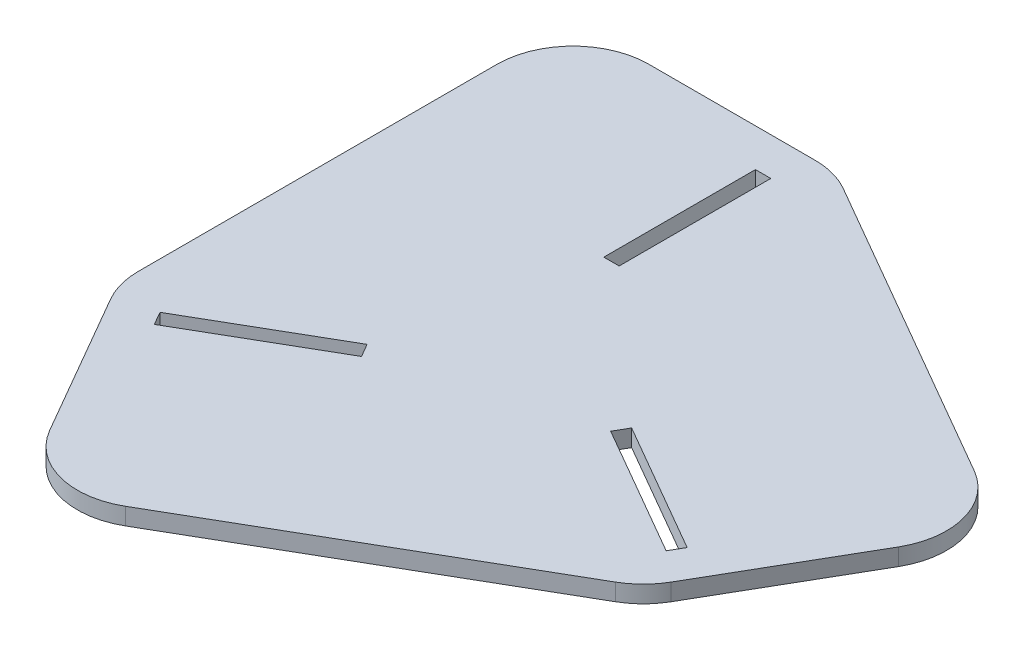
ISO-10303-21;
HEADER;
FILE_DESCRIPTION(('STEP AP214'),'2;1');
FILE_NAME('part.step','',(''),(''),'','','');
FILE_SCHEMA(('AUTOMOTIVE_DESIGN { 1 0 10303 214 1 1 1 1 }'));
ENDSEC;
DATA;
#1=APPLICATION_CONTEXT('core data for automotive mechanical design processes');
#2=APPLICATION_PROTOCOL_DEFINITION('international standard','automotive_design',2000,#1);
#3=PRODUCT_CONTEXT('',#1,'mechanical');
#4=PRODUCT('Part','Part','',(#3));
#5=PRODUCT_RELATED_PRODUCT_CATEGORY('part','',(#4));
#6=PRODUCT_DEFINITION_FORMATION('','',#4);
#7=PRODUCT_DEFINITION_CONTEXT('part definition',#1,'design');
#8=PRODUCT_DEFINITION('design','',#6,#7);
#9=PRODUCT_DEFINITION_SHAPE('','',#8);
#10=(LENGTH_UNIT() NAMED_UNIT(*) SI_UNIT(.MILLI.,.METRE.));
#11=(NAMED_UNIT(*) PLANE_ANGLE_UNIT() SI_UNIT($,.RADIAN.));
#12=(NAMED_UNIT(*) SI_UNIT($,.STERADIAN.) SOLID_ANGLE_UNIT());
#13=UNCERTAINTY_MEASURE_WITH_UNIT(LENGTH_MEASURE(1.E-05),#10,'distance_accuracy_value','');
#14=(GEOMETRIC_REPRESENTATION_CONTEXT(3) GLOBAL_UNCERTAINTY_ASSIGNED_CONTEXT((#13)) GLOBAL_UNIT_ASSIGNED_CONTEXT((#10,
#11,#12)) REPRESENTATION_CONTEXT('',''));
#15=CARTESIAN_POINT('',(0.,0.,0.));
#16=DIRECTION('',(0.,0.,1.));
#17=DIRECTION('',(1.,0.,0.));
#18=AXIS2_PLACEMENT_3D('',#15,#16,#17);
#19=CARTESIAN_POINT('',(25.9807621135332,4.5,15.));
#20=DIRECTION('',(0.866025403784439,0.,0.499999999999999));
#21=DIRECTION('',(0.499999999999999,0.,-0.866025403784439));
#22=AXIS2_PLACEMENT_3D('',#19,#20,#21);
#23=PLANE('',#22);
#24=DIRECTION('',(-0.499999999999999,0.,0.866025403784439));
#25=VECTOR('',#24,1.);
#26=CARTESIAN_POINT('',(25.9807621135332,0.,15.));
#27=LINE('',#26,#25);
#28=CARTESIAN_POINT('',(31.5512701892219,0.,5.3515969889343));
#29=VERTEX_POINT('',#28);
#30=CARTESIAN_POINT('',(29.5262701892219,0.,8.85899987426128));
#31=VERTEX_POINT('',#30);
#32=EDGE_CURVE('E315',#29,#31,#27,.T.);
#33=ORIENTED_EDGE('',*,*,#32,.F.);
#34=DIRECTION('',(0.,-1.,0.));
#35=VECTOR('',#34,1.);
#36=CARTESIAN_POINT('',(31.5512701892219,4.5,5.3515969889343));
#37=LINE('',#36,#35);
#38=CARTESIAN_POINT('',(31.5512701892219,4.5,5.3515969889343));
#39=VERTEX_POINT('',#38);
#40=EDGE_CURVE('E331',#39,#29,#37,.T.);
#41=ORIENTED_EDGE('',*,*,#40,.F.);
#42=DIRECTION('',(-0.499999999999999,0.,0.866025403784439));
#43=VECTOR('',#42,1.);
#44=CARTESIAN_POINT('',(25.9807621135332,4.5,15.));
#45=LINE('',#44,#43);
#46=CARTESIAN_POINT('',(29.5262701892219,4.5,8.85899987426128));
#47=VERTEX_POINT('',#46);
#48=EDGE_CURVE('E265',#39,#47,#45,.T.);
#49=ORIENTED_EDGE('',*,*,#48,.T.);
#50=DIRECTION('',(0.,-1.,0.));
#51=VECTOR('',#50,1.);
#52=CARTESIAN_POINT('',(29.5262701892219,4.5,8.85899987426128));
#53=LINE('',#52,#51);
#54=EDGE_CURVE('E323',#47,#31,#53,.T.);
#55=ORIENTED_EDGE('',*,*,#54,.T.);
#56=EDGE_LOOP('',(#33,#41,#49,#55));
#57=FACE_BOUND('',#56,.T.);
#58=ADVANCED_FACE('F43',(#57),#23,.T.);
#59=CARTESIAN_POINT('',(5.57050807568877,4.5,-9.64840301106569));
#60=DIRECTION('',(0.5,0.,-0.866025403784439));
#61=DIRECTION('',(-0.866025403784439,0.,-0.5));
#62=AXIS2_PLACEMENT_3D('',#59,#60,#61);
#63=PLANE('',#62);
#64=DIRECTION('',(0.866025403784439,0.,0.5));
#65=VECTOR('',#64,1.);
#66=CARTESIAN_POINT('',(5.57050807568877,0.,-9.64840301106569));
#67=LINE('',#66,#65);
#68=CARTESIAN_POINT('',(66.1922863405995,0.,25.3515969889343));
#69=VERTEX_POINT('',#68);
#70=EDGE_CURVE('E318',#29,#69,#67,.T.);
#71=ORIENTED_EDGE('',*,*,#70,.T.);
#72=DIRECTION('',(0.,-1.,0.));
#73=VECTOR('',#72,1.);
#74=CARTESIAN_POINT('',(66.1922863405995,4.5,25.3515969889343));
#75=LINE('',#74,#73);
#76=CARTESIAN_POINT('',(66.1922863405995,4.5,25.3515969889343));
#77=VERTEX_POINT('',#76);
#78=EDGE_CURVE('E328',#77,#69,#75,.T.);
#79=ORIENTED_EDGE('',*,*,#78,.F.);
#80=DIRECTION('',(0.866025403784439,0.,0.5));
#81=VECTOR('',#80,1.);
#82=CARTESIAN_POINT('',(5.57050807568877,4.5,-9.64840301106569));
#83=LINE('',#82,#81);
#84=EDGE_CURVE('E268',#39,#77,#83,.T.);
#85=ORIENTED_EDGE('',*,*,#84,.F.);
#86=ORIENTED_EDGE('',*,*,#40,.T.);
#87=EDGE_LOOP('',(#71,#79,#85,#86));
#88=FACE_BOUND('',#87,.T.);
#89=ADVANCED_FACE('F452',(#88),#63,.F.);
#90=CARTESIAN_POINT('',(60.6217782649108,4.5,35.));
#91=DIRECTION('',(0.866025403784439,0.,0.5));
#92=DIRECTION('',(0.5,0.,-0.866025403784439));
#93=AXIS2_PLACEMENT_3D('',#90,#91,#92);
#94=PLANE('',#93);
#95=DIRECTION('',(-0.5,0.,0.866025403784439));
#96=VECTOR('',#95,1.);
#97=CARTESIAN_POINT('',(60.6217782649108,0.,35.));
#98=LINE('',#97,#96);
#99=CARTESIAN_POINT('',(64.1672863405995,0.,28.8589998742613));
#100=VERTEX_POINT('',#99);
#101=EDGE_CURVE('E233',#69,#100,#98,.T.);
#102=ORIENTED_EDGE('',*,*,#101,.T.);
#103=DIRECTION('',(0.,-1.,0.));
#104=VECTOR('',#103,1.);
#105=CARTESIAN_POINT('',(64.1672863405995,4.5,28.8589998742613));
#106=LINE('',#105,#104);
#107=CARTESIAN_POINT('',(64.1672863405995,4.5,28.8589998742613));
#108=VERTEX_POINT('',#107);
#109=EDGE_CURVE('E325',#108,#100,#106,.T.);
#110=ORIENTED_EDGE('',*,*,#109,.F.);
#111=DIRECTION('',(-0.5,0.,0.866025403784439));
#112=VECTOR('',#111,1.);
#113=CARTESIAN_POINT('',(60.6217782649108,4.5,35.));
#114=LINE('',#113,#112);
#115=EDGE_CURVE('E271',#77,#108,#114,.T.);
#116=ORIENTED_EDGE('',*,*,#115,.F.);
#117=ORIENTED_EDGE('',*,*,#78,.T.);
#118=EDGE_LOOP('',(#102,#110,#116,#117));
#119=FACE_BOUND('',#118,.T.);
#120=ADVANCED_FACE('F458',(#119),#94,.F.);
#121=CARTESIAN_POINT('',(-69.2820323027551,4.5,0.));
#122=DIRECTION('',(1.,0.,0.));
#123=DIRECTION('',(0.,0.,-1.));
#124=AXIS2_PLACEMENT_3D('',#121,#122,#123);
#125=PLANE('',#124);
#126=DIRECTION('',(0.,0.,1.));
#127=VECTOR('',#126,1.);
#128=CARTESIAN_POINT('',(-69.2820323027551,0.,0.));
#129=LINE('',#128,#127);
#130=CARTESIAN_POINT('',(-69.2820323027551,0.,-60.));
#131=VERTEX_POINT('',#130);
#132=CARTESIAN_POINT('',(-69.2820323027551,0.,34.6410161513775));
#133=VERTEX_POINT('',#132);
#134=EDGE_CURVE('E298',#131,#133,#129,.T.);
#135=ORIENTED_EDGE('',*,*,#134,.T.);
#136=DIRECTION('',(0.,-1.,0.));
#137=VECTOR('',#136,1.);
#138=CARTESIAN_POINT('',(-69.2820323027551,4.5,34.6410161513775));
#139=LINE('',#138,#137);
#140=CARTESIAN_POINT('',(-69.2820323027551,4.5,34.6410161513775));
#141=VERTEX_POINT('',#140);
#142=EDGE_CURVE('E11',#133,#141,#139,.F.);
#143=ORIENTED_EDGE('',*,*,#142,.T.);
#144=DIRECTION('',(0.,0.,1.));
#145=VECTOR('',#144,1.);
#146=CARTESIAN_POINT('',(-69.2820323027551,4.5,0.));
#147=LINE('',#146,#145);
#148=CARTESIAN_POINT('',(-69.2820323027551,4.5,-60.));
#149=VERTEX_POINT('',#148);
#150=EDGE_CURVE('E249',#149,#141,#147,.T.);
#151=ORIENTED_EDGE('',*,*,#150,.F.);
#152=DIRECTION('',(0.,-1.,0.));
#153=VECTOR('',#152,1.);
#154=CARTESIAN_POINT('',(-69.2820323027551,4.5,-60.));
#155=LINE('',#154,#153);
#156=EDGE_CURVE('E51',#149,#131,#155,.T.);
#157=ORIENTED_EDGE('',*,*,#156,.T.);
#158=EDGE_LOOP('',(#135,#143,#151,#157));
#159=FACE_BOUND('',#158,.T.);
#160=ADVANCED_FACE('F395',(#159),#125,.F.);
#161=CARTESIAN_POINT('',(-69.2820323027551,4.5,40.));
#162=DIRECTION('',(0.866025403784438,0.,-0.5));
#163=DIRECTION('',(-0.500000000000001,0.,-0.866025403784438));
#164=AXIS2_PLACEMENT_3D('',#161,#162,#163);
#165=PLANE('',#164);
#166=DIRECTION('',(0.5,0.,0.866025403784438));
#167=VECTOR('',#166,1.);
#168=CARTESIAN_POINT('',(-69.2820323027551,4.5,40.));
#169=LINE('',#168,#167);
#170=CARTESIAN_POINT('',(-66.6025403784439,4.5,44.6410161513775));
#171=VERTEX_POINT('',#170);
#172=CARTESIAN_POINT('',(-44.6410161513775,4.5,82.6794919243113));
#173=VERTEX_POINT('',#172);
#174=EDGE_CURVE('E252',#171,#173,#169,.T.);
#175=ORIENTED_EDGE('',*,*,#174,.F.);
#176=DIRECTION('',(0.,-1.,0.));
#177=VECTOR('',#176,1.);
#178=CARTESIAN_POINT('',(-66.6025403784439,4.5,44.6410161513775));
#179=LINE('',#178,#177);
#180=CARTESIAN_POINT('',(-66.6025403784439,0.,44.6410161513775));
#181=VERTEX_POINT('',#180);
#182=EDGE_CURVE('E388',#171,#181,#179,.T.);
#183=ORIENTED_EDGE('',*,*,#182,.T.);
#184=DIRECTION('',(0.5,0.,0.866025403784438));
#185=VECTOR('',#184,1.);
#186=CARTESIAN_POINT('',(-69.2820323027551,0.,40.));
#187=LINE('',#186,#185);
#188=CARTESIAN_POINT('',(-44.6410161513775,0.,82.6794919243113));
#189=VERTEX_POINT('',#188);
#190=EDGE_CURVE('E301',#181,#189,#187,.T.);
#191=ORIENTED_EDGE('',*,*,#190,.T.);
#192=DIRECTION('',(0.,-1.,0.));
#193=VECTOR('',#192,1.);
#194=CARTESIAN_POINT('',(-44.6410161513775,4.5,82.6794919243113));
#195=LINE('',#194,#193);
#196=EDGE_CURVE('E386',#189,#173,#195,.F.);
#197=ORIENTED_EDGE('',*,*,#196,.T.);
#198=EDGE_LOOP('',(#175,#183,#191,#197));
#199=FACE_BOUND('',#198,.T.);
#200=ADVANCED_FACE('F411',(#199),#165,.F.);
#201=CARTESIAN_POINT('',(34.6410161513776,4.5,60.));
#202=DIRECTION('',(-0.5,0.,-0.866025403784438));
#203=DIRECTION('',(-0.866025403784439,0.,0.5));
#204=AXIS2_PLACEMENT_3D('',#201,#202,#203);
#205=PLANE('',#204);
#206=DIRECTION('',(0.866025403784438,0.,-0.5));
#207=VECTOR('',#206,1.);
#208=CARTESIAN_POINT('',(34.6410161513776,0.,60.));
#209=LINE('',#208,#207);
#210=CARTESIAN_POINT('',(-17.3205080756887,0.,90.));
#211=VERTEX_POINT('',#210);
#212=CARTESIAN_POINT('',(64.6410161513776,0.,42.6794919243112));
#213=VERTEX_POINT('',#212);
#214=EDGE_CURVE('E304',#211,#213,#209,.T.);
#215=ORIENTED_EDGE('',*,*,#214,.T.);
#216=DIRECTION('',(0.,-1.,0.));
#217=VECTOR('',#216,1.);
#218=CARTESIAN_POINT('',(64.6410161513776,4.5,42.6794919243112));
#219=LINE('',#218,#217);
#220=CARTESIAN_POINT('',(64.6410161513776,4.5,42.6794919243112));
#221=VERTEX_POINT('',#220);
#222=EDGE_CURVE('E364',#213,#221,#219,.F.);
#223=ORIENTED_EDGE('',*,*,#222,.T.);
#224=DIRECTION('',(0.866025403784438,0.,-0.5));
#225=VECTOR('',#224,1.);
#226=CARTESIAN_POINT('',(34.6410161513776,4.5,60.));
#227=LINE('',#226,#225);
#228=CARTESIAN_POINT('',(-17.3205080756887,4.5,90.));
#229=VERTEX_POINT('',#228);
#230=EDGE_CURVE('E255',#229,#221,#227,.T.);
#231=ORIENTED_EDGE('',*,*,#230,.F.);
#232=DIRECTION('',(0.,-1.,0.));
#233=VECTOR('',#232,1.);
#234=CARTESIAN_POINT('',(-17.3205080756887,4.5,90.));
#235=LINE('',#234,#233);
#236=EDGE_CURVE('E361',#229,#211,#235,.T.);
#237=ORIENTED_EDGE('',*,*,#236,.T.);
#238=EDGE_LOOP('',(#215,#223,#231,#237));
#239=FACE_BOUND('',#238,.T.);
#240=ADVANCED_FACE('F420',(#239),#205,.F.);
#241=CARTESIAN_POINT('',(69.2820323027551,4.5,40.));
#242=DIRECTION('',(-0.866025403784439,0.,-0.5));
#243=DIRECTION('',(-0.5,0.,0.866025403784439));
#244=AXIS2_PLACEMENT_3D('',#241,#242,#243);
#245=PLANE('',#244);
#246=DIRECTION('',(0.5,0.,-0.866025403784439));
#247=VECTOR('',#246,1.);
#248=CARTESIAN_POINT('',(69.2820323027551,4.5,40.));
#249=LINE('',#248,#247);
#250=CARTESIAN_POINT('',(71.9615242270663,4.5,35.3589838486224));
#251=VERTEX_POINT('',#250);
#252=CARTESIAN_POINT('',(93.9230484541327,4.5,-2.67949192431128));
#253=VERTEX_POINT('',#252);
#254=EDGE_CURVE('E258',#251,#253,#249,.T.);
#255=ORIENTED_EDGE('',*,*,#254,.F.);
#256=DIRECTION('',(0.,-1.,0.));
#257=VECTOR('',#256,1.);
#258=CARTESIAN_POINT('',(71.9615242270663,4.5,35.3589838486224));
#259=LINE('',#258,#257);
#260=CARTESIAN_POINT('',(71.9615242270663,0.,35.3589838486224));
#261=VERTEX_POINT('',#260);
#262=EDGE_CURVE('E346',#251,#261,#259,.T.);
#263=ORIENTED_EDGE('',*,*,#262,.T.);
#264=DIRECTION('',(0.5,0.,-0.866025403784439));
#265=VECTOR('',#264,1.);
#266=CARTESIAN_POINT('',(69.2820323027551,0.,40.));
#267=LINE('',#266,#265);
#268=CARTESIAN_POINT('',(93.9230484541327,0.,-2.67949192431128));
#269=VERTEX_POINT('',#268);
#270=EDGE_CURVE('E307',#261,#269,#267,.T.);
#271=ORIENTED_EDGE('',*,*,#270,.T.);
#272=DIRECTION('',(0.,-1.,0.));
#273=VECTOR('',#272,1.);
#274=CARTESIAN_POINT('',(93.9230484541327,4.5,-2.67949192431128));
#275=LINE('',#274,#273);
#276=EDGE_CURVE('E333',#269,#253,#275,.F.);
#277=ORIENTED_EDGE('',*,*,#276,.T.);
#278=EDGE_LOOP('',(#255,#263,#271,#277));
#279=FACE_BOUND('',#278,.T.);
#280=ADVANCED_FACE('F428',(#279),#245,.F.);
#281=CARTESIAN_POINT('',(34.6410161513775,4.5,-60.));
#282=DIRECTION('',(-0.5,0.,0.866025403784439));
#283=DIRECTION('',(0.866025403784439,0.,0.5));
#284=AXIS2_PLACEMENT_3D('',#281,#282,#283);
#285=PLANE('',#284);
#286=DIRECTION('',(-0.866025403784439,0.,-0.5));
#287=VECTOR('',#286,1.);
#288=CARTESIAN_POINT('',(34.6410161513775,0.,-60.));
#289=LINE('',#288,#287);
#290=CARTESIAN_POINT('',(86.6025403784439,0.,-30.));
#291=VERTEX_POINT('',#290);
#292=CARTESIAN_POINT('',(4.64101615137755,0.,-77.3205080756888));
#293=VERTEX_POINT('',#292);
#294=EDGE_CURVE('E310',#291,#293,#289,.T.);
#295=ORIENTED_EDGE('',*,*,#294,.T.);
#296=DIRECTION('',(0.,-1.,0.));
#297=VECTOR('',#296,1.);
#298=CARTESIAN_POINT('',(4.64101615137755,4.5,-77.3205080756888));
#299=LINE('',#298,#297);
#300=CARTESIAN_POINT('',(4.64101615137755,4.5,-77.3205080756888));
#301=VERTEX_POINT('',#300);
#302=EDGE_CURVE('E384',#293,#301,#299,.F.);
#303=ORIENTED_EDGE('',*,*,#302,.T.);
#304=DIRECTION('',(-0.866025403784439,0.,-0.5));
#305=VECTOR('',#304,1.);
#306=CARTESIAN_POINT('',(34.6410161513775,4.5,-60.));
#307=LINE('',#306,#305);
#308=CARTESIAN_POINT('',(86.6025403784439,4.5,-30.));
#309=VERTEX_POINT('',#308);
#310=EDGE_CURVE('E261',#309,#301,#307,.T.);
#311=ORIENTED_EDGE('',*,*,#310,.F.);
#312=DIRECTION('',(0.,-1.,0.));
#313=VECTOR('',#312,1.);
#314=CARTESIAN_POINT('',(86.6025403784439,4.5,-30.));
#315=LINE('',#314,#313);
#316=EDGE_CURVE('E381',#309,#291,#315,.T.);
#317=ORIENTED_EDGE('',*,*,#316,.T.);
#318=EDGE_LOOP('',(#295,#303,#311,#317));
#319=FACE_BOUND('',#318,.T.);
#320=ADVANCED_FACE('F437',(#319),#285,.F.);
#321=CARTESIAN_POINT('',(0.,4.5,-30.));
#322=DIRECTION('',(0.,0.,-1.));
#323=DIRECTION('',(-1.,0.,0.));
#324=AXIS2_PLACEMENT_3D('',#321,#322,#323);
#325=PLANE('',#324);
#326=DIRECTION('',(1.,0.,0.));
#327=VECTOR('',#326,1.);
#328=CARTESIAN_POINT('',(0.,0.,-30.));
#329=LINE('',#328,#327);
#330=CARTESIAN_POINT('',(-11.1410161513776,0.,-30.));
#331=VERTEX_POINT('',#330);
#332=CARTESIAN_POINT('',(-7.09101615137755,0.,-30.));
#333=VERTEX_POINT('',#332);
#334=EDGE_CURVE('E286',#331,#333,#329,.T.);
#335=ORIENTED_EDGE('',*,*,#334,.F.);
#336=DIRECTION('',(0.,-1.,0.));
#337=VECTOR('',#336,1.);
#338=CARTESIAN_POINT('',(-11.1410161513776,4.5,-30.));
#339=LINE('',#338,#337);
#340=CARTESIAN_POINT('',(-11.1410161513776,4.5,-30.));
#341=VERTEX_POINT('',#340);
#342=EDGE_CURVE('E326',#341,#331,#339,.T.);
#343=ORIENTED_EDGE('',*,*,#342,.F.);
#344=DIRECTION('',(1.,0.,0.));
#345=VECTOR('',#344,1.);
#346=CARTESIAN_POINT('',(0.,4.5,-30.));
#347=LINE('',#346,#345);
#348=CARTESIAN_POINT('',(-7.09101615137755,4.5,-30.));
#349=VERTEX_POINT('',#348);
#350=EDGE_CURVE('E238',#341,#349,#347,.T.);
#351=ORIENTED_EDGE('',*,*,#350,.T.);
#352=DIRECTION('',(0.,-1.,0.));
#353=VECTOR('',#352,1.);
#354=CARTESIAN_POINT('',(-7.09101615137755,4.5,-30.));
#355=LINE('',#354,#353);
#356=EDGE_CURVE('E215',#349,#333,#355,.T.);
#357=ORIENTED_EDGE('',*,*,#356,.T.);
#358=EDGE_LOOP('',(#335,#343,#351,#357));
#359=FACE_BOUND('',#358,.T.);
#360=ADVANCED_FACE('F470',(#359),#325,.T.);
#361=CARTESIAN_POINT('',(-11.1410161513776,4.5,0.));
#362=DIRECTION('',(-1.,0.,0.));
#363=DIRECTION('',(0.,0.,1.));
#364=AXIS2_PLACEMENT_3D('',#361,#362,#363);
#365=PLANE('',#364);
#366=DIRECTION('',(0.,0.,-1.));
#367=VECTOR('',#366,1.);
#368=CARTESIAN_POINT('',(-11.1410161513776,0.,0.));
#369=LINE('',#368,#367);
#370=CARTESIAN_POINT('',(-11.1410161513776,0.,-70.));
#371=VERTEX_POINT('',#370);
#372=EDGE_CURVE('E289',#331,#371,#369,.T.);
#373=ORIENTED_EDGE('',*,*,#372,.T.);
#374=DIRECTION('',(0.,-1.,0.));
#375=VECTOR('',#374,1.);
#376=CARTESIAN_POINT('',(-11.1410161513776,4.5,-70.));
#377=LINE('',#376,#375);
#378=CARTESIAN_POINT('',(-11.1410161513776,4.5,-70.));
#379=VERTEX_POINT('',#378);
#380=EDGE_CURVE('E337',#379,#371,#377,.T.);
#381=ORIENTED_EDGE('',*,*,#380,.F.);
#382=DIRECTION('',(0.,0.,-1.));
#383=VECTOR('',#382,1.);
#384=CARTESIAN_POINT('',(-11.1410161513776,4.5,0.));
#385=LINE('',#384,#383);
#386=EDGE_CURVE('E241',#341,#379,#385,.T.);
#387=ORIENTED_EDGE('',*,*,#386,.F.);
#388=ORIENTED_EDGE('',*,*,#342,.T.);
#389=EDGE_LOOP('',(#373,#381,#387,#388));
#390=FACE_BOUND('',#389,.T.);
#391=ADVANCED_FACE('F486',(#390),#365,.F.);
#392=CARTESIAN_POINT('',(0.,4.5,-70.));
#393=DIRECTION('',(0.,0.,-1.));
#394=DIRECTION('',(-1.,0.,0.));
#395=AXIS2_PLACEMENT_3D('',#392,#393,#394);
#396=PLANE('',#395);
#397=DIRECTION('',(1.,0.,0.));
#398=VECTOR('',#397,1.);
#399=CARTESIAN_POINT('',(0.,0.,-70.));
#400=LINE('',#399,#398);
#401=CARTESIAN_POINT('',(-7.09101615137755,0.,-70.));
#402=VERTEX_POINT('',#401);
#403=EDGE_CURVE('E292',#371,#402,#400,.T.);
#404=ORIENTED_EDGE('',*,*,#403,.T.);
#405=DIRECTION('',(0.,-1.,0.));
#406=VECTOR('',#405,1.);
#407=CARTESIAN_POINT('',(-7.09101615137755,4.5,-70.));
#408=LINE('',#407,#406);
#409=CARTESIAN_POINT('',(-7.09101615137755,4.5,-70.));
#410=VERTEX_POINT('',#409);
#411=EDGE_CURVE('E335',#410,#402,#408,.T.);
#412=ORIENTED_EDGE('',*,*,#411,.F.);
#413=DIRECTION('',(1.,0.,0.));
#414=VECTOR('',#413,1.);
#415=CARTESIAN_POINT('',(0.,4.5,-70.));
#416=LINE('',#415,#414);
#417=EDGE_CURVE('E244',#379,#410,#416,.T.);
#418=ORIENTED_EDGE('',*,*,#417,.F.);
#419=ORIENTED_EDGE('',*,*,#380,.T.);
#420=EDGE_LOOP('',(#404,#412,#418,#419));
#421=FACE_BOUND('',#420,.T.);
#422=ADVANCED_FACE('F483',(#421),#396,.F.);
#423=CARTESIAN_POINT('',(-25.9807621135331,4.5,15.));
#424=DIRECTION('',(-0.866025403784438,0.,0.500000000000001));
#425=DIRECTION('',(0.500000000000001,0.,0.866025403784438));
#426=AXIS2_PLACEMENT_3D('',#423,#424,#425);
#427=PLANE('',#426);
#428=DIRECTION('',(-0.500000000000001,0.,-0.866025403784438));
#429=VECTOR('',#428,1.);
#430=CARTESIAN_POINT('',(-25.9807621135331,0.,15.));
#431=LINE('',#430,#429);
#432=CARTESIAN_POINT('',(-20.4102540378444,0.,24.6484030110657));
#433=VERTEX_POINT('',#432);
#434=CARTESIAN_POINT('',(-22.4352540378444,0.,21.1410001257387));
#435=VERTEX_POINT('',#434);
#436=EDGE_CURVE('E212',#433,#435,#431,.T.);
#437=ORIENTED_EDGE('',*,*,#436,.F.);
#438=DIRECTION('',(0.,-1.,0.));
#439=VECTOR('',#438,1.);
#440=CARTESIAN_POINT('',(-20.4102540378444,4.5,24.6484030110657));
#441=LINE('',#440,#439);
#442=CARTESIAN_POINT('',(-20.4102540378444,4.5,24.6484030110657));
#443=VERTEX_POINT('',#442);
#444=EDGE_CURVE('E205',#443,#433,#441,.T.);
#445=ORIENTED_EDGE('',*,*,#444,.F.);
#446=DIRECTION('',(-0.500000000000001,0.,-0.866025403784438));
#447=VECTOR('',#446,1.);
#448=CARTESIAN_POINT('',(-25.9807621135331,4.5,15.));
#449=LINE('',#448,#447);
#450=CARTESIAN_POINT('',(-22.4352540378444,4.5,21.1410001257387));
#451=VERTEX_POINT('',#450);
#452=EDGE_CURVE('E209',#443,#451,#449,.T.);
#453=ORIENTED_EDGE('',*,*,#452,.T.);
#454=DIRECTION('',(0.,-1.,0.));
#455=VECTOR('',#454,1.);
#456=CARTESIAN_POINT('',(-22.4352540378444,4.5,21.1410001257387));
#457=LINE('',#456,#455);
#458=EDGE_CURVE('E276',#451,#435,#457,.T.);
#459=ORIENTED_EDGE('',*,*,#458,.T.);
#460=EDGE_LOOP('',(#437,#445,#453,#459));
#461=FACE_BOUND('',#460,.T.);
#462=ADVANCED_FACE('F207',(#461),#427,.T.);
#463=CARTESIAN_POINT('',(5.57050807568878,4.5,9.64840301106569));
#464=DIRECTION('',(0.5,0.,0.866025403784438));
#465=DIRECTION('',(0.866025403784438,0.,-0.500000000000001));
#466=AXIS2_PLACEMENT_3D('',#463,#464,#465);
#467=PLANE('',#466);
#468=DIRECTION('',(-0.866025403784438,0.,0.5));
#469=VECTOR('',#468,1.);
#470=CARTESIAN_POINT('',(5.57050807568878,0.,9.64840301106569));
#471=LINE('',#470,#469);
#472=CARTESIAN_POINT('',(-55.0512701892219,0.,44.6484030110657));
#473=VERTEX_POINT('',#472);
#474=EDGE_CURVE('E278',#433,#473,#471,.T.);
#475=ORIENTED_EDGE('',*,*,#474,.T.);
#476=DIRECTION('',(0.,-1.,0.));
#477=VECTOR('',#476,1.);
#478=CARTESIAN_POINT('',(-55.0512701892219,4.5,44.6484030110657));
#479=LINE('',#478,#477);
#480=CARTESIAN_POINT('',(-55.0512701892219,4.5,44.6484030110657));
#481=VERTEX_POINT('',#480);
#482=EDGE_CURVE('E216',#481,#473,#479,.T.);
#483=ORIENTED_EDGE('',*,*,#482,.F.);
#484=DIRECTION('',(-0.866025403784438,0.,0.5));
#485=VECTOR('',#484,1.);
#486=CARTESIAN_POINT('',(5.57050807568878,4.5,9.64840301106569));
#487=LINE('',#486,#485);
#488=EDGE_CURVE('E219',#443,#481,#487,.T.);
#489=ORIENTED_EDGE('',*,*,#488,.F.);
#490=ORIENTED_EDGE('',*,*,#444,.T.);
#491=EDGE_LOOP('',(#475,#483,#489,#490));
#492=FACE_BOUND('',#491,.T.);
#493=ADVANCED_FACE('F220',(#492),#467,.F.);
#494=CARTESIAN_POINT('',(-60.6217782649107,4.5,35.));
#495=DIRECTION('',(-0.866025403784439,0.,0.5));
#496=DIRECTION('',(0.5,0.,0.866025403784439));
#497=AXIS2_PLACEMENT_3D('',#494,#495,#496);
#498=PLANE('',#497);
#499=DIRECTION('',(-0.5,0.,-0.866025403784439));
#500=VECTOR('',#499,1.);
#501=CARTESIAN_POINT('',(-60.6217782649107,0.,35.));
#502=LINE('',#501,#500);
#503=CARTESIAN_POINT('',(-57.0762701892219,0.,41.1410001257388));
#504=VERTEX_POINT('',#503);
#505=EDGE_CURVE('E280',#473,#504,#502,.T.);
#506=ORIENTED_EDGE('',*,*,#505,.T.);
#507=DIRECTION('',(0.,-1.,0.));
#508=VECTOR('',#507,1.);
#509=CARTESIAN_POINT('',(-57.0762701892219,4.5,41.1410001257388));
#510=LINE('',#509,#508);
#511=CARTESIAN_POINT('',(-57.0762701892219,4.5,41.1410001257388));
#512=VERTEX_POINT('',#511);
#513=EDGE_CURVE('E342',#512,#504,#510,.T.);
#514=ORIENTED_EDGE('',*,*,#513,.F.);
#515=DIRECTION('',(-0.5,0.,-0.866025403784439));
#516=VECTOR('',#515,1.);
#517=CARTESIAN_POINT('',(-60.6217782649107,4.5,35.));
#518=LINE('',#517,#516);
#519=EDGE_CURVE('E224',#481,#512,#518,.T.);
#520=ORIENTED_EDGE('',*,*,#519,.F.);
#521=ORIENTED_EDGE('',*,*,#482,.T.);
#522=EDGE_LOOP('',(#506,#514,#520,#521));
#523=FACE_BOUND('',#522,.T.);
#524=ADVANCED_FACE('F467',(#523),#498,.F.);
#525=CARTESIAN_POINT('',(0.,4.5,-80.));
#526=DIRECTION('',(0.,0.,1.));
#527=DIRECTION('',(1.,0.,0.));
#528=AXIS2_PLACEMENT_3D('',#525,#526,#527);
#529=PLANE('',#528);
#530=DIRECTION('',(-1.,0.,0.));
#531=VECTOR('',#530,1.);
#532=CARTESIAN_POINT('',(0.,4.5,-80.));
#533=LINE('',#532,#531);
#534=CARTESIAN_POINT('',(-5.35898384862245,4.5,-80.));
#535=VERTEX_POINT('',#534);
#536=CARTESIAN_POINT('',(-49.2820323027551,4.5,-80.));
#537=VERTEX_POINT('',#536);
#538=EDGE_CURVE('E263',#535,#537,#533,.T.);
#539=ORIENTED_EDGE('',*,*,#538,.F.);
#540=DIRECTION('',(0.,-1.,0.));
#541=VECTOR('',#540,1.);
#542=CARTESIAN_POINT('',(-5.35898384862245,4.5,-80.));
#543=LINE('',#542,#541);
#544=CARTESIAN_POINT('',(-5.35898384862245,0.,-80.));
#545=VERTEX_POINT('',#544);
#546=EDGE_CURVE('E378',#535,#545,#543,.T.);
#547=ORIENTED_EDGE('',*,*,#546,.T.);
#548=DIRECTION('',(-1.,0.,0.));
#549=VECTOR('',#548,1.);
#550=CARTESIAN_POINT('',(0.,0.,-80.));
#551=LINE('',#550,#549);
#552=CARTESIAN_POINT('',(-49.2820323027551,0.,-80.));
#553=VERTEX_POINT('',#552);
#554=EDGE_CURVE('E313',#545,#553,#551,.T.);
#555=ORIENTED_EDGE('',*,*,#554,.T.);
#556=DIRECTION('',(0.,-1.,0.));
#557=VECTOR('',#556,1.);
#558=CARTESIAN_POINT('',(-49.2820323027551,4.5,-80.));
#559=LINE('',#558,#557);
#560=EDGE_CURVE('E58',#553,#537,#559,.F.);
#561=ORIENTED_EDGE('',*,*,#560,.T.);
#562=EDGE_LOOP('',(#539,#547,#555,#561));
#563=FACE_BOUND('',#562,.T.);
#564=ADVANCED_FACE('F442',(#563),#529,.F.);
#565=CARTESIAN_POINT('',(-7.09101615137755,4.5,0.));
#566=DIRECTION('',(-1.,0.,0.));
#567=DIRECTION('',(0.,0.,1.));
#568=AXIS2_PLACEMENT_3D('',#565,#566,#567);
#569=PLANE('',#568);
#570=DIRECTION('',(0.,0.,-1.));
#571=VECTOR('',#570,1.);
#572=CARTESIAN_POINT('',(-7.09101615137755,0.,0.));
#573=LINE('',#572,#571);
#574=EDGE_CURVE('E295',#333,#402,#573,.T.);
#575=ORIENTED_EDGE('',*,*,#574,.F.);
#576=ORIENTED_EDGE('',*,*,#356,.F.);
#577=DIRECTION('',(0.,0.,-1.));
#578=VECTOR('',#577,1.);
#579=CARTESIAN_POINT('',(-7.09101615137755,4.5,0.));
#580=LINE('',#579,#578);
#581=EDGE_CURVE('E246',#349,#410,#580,.T.);
#582=ORIENTED_EDGE('',*,*,#581,.T.);
#583=ORIENTED_EDGE('',*,*,#411,.T.);
#584=EDGE_LOOP('',(#575,#576,#582,#583));
#585=FACE_BOUND('',#584,.T.);
#586=ADVANCED_FACE('F466',(#585),#569,.T.);
#587=CARTESIAN_POINT('',(3.54550807568878,4.5,6.14100012573872));
#588=DIRECTION('',(0.5,0.,0.866025403784438));
#589=DIRECTION('',(0.866025403784438,0.,-0.500000000000001));
#590=AXIS2_PLACEMENT_3D('',#587,#588,#589);
#591=PLANE('',#590);
#592=DIRECTION('',(-0.866025403784438,0.,0.5));
#593=VECTOR('',#592,1.);
#594=CARTESIAN_POINT('',(3.54550807568878,0.,6.14100012573872));
#595=LINE('',#594,#593);
#596=EDGE_CURVE('E283',#435,#504,#595,.T.);
#597=ORIENTED_EDGE('',*,*,#596,.F.);
#598=ORIENTED_EDGE('',*,*,#458,.F.);
#599=DIRECTION('',(-0.866025403784438,0.,0.5));
#600=VECTOR('',#599,1.);
#601=CARTESIAN_POINT('',(3.54550807568878,4.5,6.14100012573872));
#602=LINE('',#601,#600);
#603=EDGE_CURVE('E229',#451,#512,#602,.T.);
#604=ORIENTED_EDGE('',*,*,#603,.T.);
#605=ORIENTED_EDGE('',*,*,#513,.T.);
#606=EDGE_LOOP('',(#597,#598,#604,#605));
#607=FACE_BOUND('',#606,.T.);
#608=ADVANCED_FACE('F481',(#607),#591,.T.);
#609=CARTESIAN_POINT('',(3.54550807568877,4.5,-6.14100012573872));
#610=DIRECTION('',(0.5,0.,-0.866025403784439));
#611=DIRECTION('',(-0.866025403784439,0.,-0.5));
#612=AXIS2_PLACEMENT_3D('',#609,#610,#611);
#613=PLANE('',#612);
#614=DIRECTION('',(0.866025403784439,0.,0.5));
#615=VECTOR('',#614,1.);
#616=CARTESIAN_POINT('',(3.54550807568877,0.,-6.14100012573872));
#617=LINE('',#616,#615);
#618=EDGE_CURVE('E230',#31,#100,#617,.T.);
#619=ORIENTED_EDGE('',*,*,#618,.F.);
#620=ORIENTED_EDGE('',*,*,#54,.F.);
#621=DIRECTION('',(0.866025403784439,0.,0.5));
#622=VECTOR('',#621,1.);
#623=CARTESIAN_POINT('',(3.54550807568877,4.5,-6.14100012573872));
#624=LINE('',#623,#622);
#625=EDGE_CURVE('E273',#47,#108,#624,.T.);
#626=ORIENTED_EDGE('',*,*,#625,.T.);
#627=ORIENTED_EDGE('',*,*,#109,.T.);
#628=EDGE_LOOP('',(#619,#620,#626,#627));
#629=FACE_BOUND('',#628,.T.);
#630=ADVANCED_FACE('F496',(#629),#613,.T.);
#631=CARTESIAN_POINT('',(0.,4.5,0.));
#632=DIRECTION('',(0.,1.,0.));
#633=DIRECTION('',(0.,0.,1.));
#634=AXIS2_PLACEMENT_3D('',#631,#632,#633);
#635=PLANE('',#634);
#636=ORIENTED_EDGE('',*,*,#452,.F.);
#637=ORIENTED_EDGE('',*,*,#488,.T.);
#638=ORIENTED_EDGE('',*,*,#519,.T.);
#639=ORIENTED_EDGE('',*,*,#603,.F.);
#640=EDGE_LOOP('',(#636,#637,#638,#639));
#641=FACE_BOUND('',#640,.T.);
#642=ORIENTED_EDGE('',*,*,#350,.F.);
#643=ORIENTED_EDGE('',*,*,#386,.T.);
#644=ORIENTED_EDGE('',*,*,#417,.T.);
#645=ORIENTED_EDGE('',*,*,#581,.F.);
#646=EDGE_LOOP('',(#642,#643,#644,#645));
#647=FACE_BOUND('',#646,.T.);
#648=ORIENTED_EDGE('',*,*,#230,.T.);
#649=CARTESIAN_POINT('',(54.6410161513776,4.5,25.3589838486224));
#650=DIRECTION('',(0.,1.,0.));
#651=DIRECTION('',(0.,0.,1.));
#652=AXIS2_PLACEMENT_3D('',#649,#650,#651);
#653=CIRCLE('',#652,20.);
#654=EDGE_CURVE('E375',#221,#251,#653,.T.);
#655=ORIENTED_EDGE('',*,*,#654,.T.);
#656=ORIENTED_EDGE('',*,*,#254,.T.);
#657=CARTESIAN_POINT('',(76.6025403784439,4.5,-12.6794919243113));
#658=DIRECTION('',(0.,1.,0.));
#659=DIRECTION('',(0.,0.,1.));
#660=AXIS2_PLACEMENT_3D('',#657,#658,#659);
#661=CIRCLE('',#660,20.);
#662=EDGE_CURVE('E368',#253,#309,#661,.T.);
#663=ORIENTED_EDGE('',*,*,#662,.T.);
#664=ORIENTED_EDGE('',*,*,#310,.T.);
#665=CARTESIAN_POINT('',(-5.35898384862244,4.5,-60.));
#666=DIRECTION('',(0.,1.,0.));
#667=DIRECTION('',(0.,0.,1.));
#668=AXIS2_PLACEMENT_3D('',#665,#666,#667);
#669=CIRCLE('',#668,20.);
#670=EDGE_CURVE('E65',#301,#535,#669,.T.);
#671=ORIENTED_EDGE('',*,*,#670,.T.);
#672=ORIENTED_EDGE('',*,*,#538,.T.);
#673=CARTESIAN_POINT('',(-49.2820323027551,4.5,-60.));
#674=DIRECTION('',(0.,1.,0.));
#675=DIRECTION('',(0.,0.,1.));
#676=AXIS2_PLACEMENT_3D('',#673,#674,#675);
#677=CIRCLE('',#676,20.);
#678=EDGE_CURVE('E370',#537,#149,#677,.T.);
#679=ORIENTED_EDGE('',*,*,#678,.T.);
#680=ORIENTED_EDGE('',*,*,#150,.T.);
#681=CARTESIAN_POINT('',(-49.2820323027551,4.5,34.6410161513775));
#682=DIRECTION('',(0.,1.,0.));
#683=DIRECTION('',(0.,0.,1.));
#684=AXIS2_PLACEMENT_3D('',#681,#682,#683);
#685=CIRCLE('',#684,20.);
#686=EDGE_CURVE('E372',#141,#171,#685,.T.);
#687=ORIENTED_EDGE('',*,*,#686,.T.);
#688=ORIENTED_EDGE('',*,*,#174,.T.);
#689=CARTESIAN_POINT('',(-27.3205080756887,4.5,72.6794919243112));
#690=DIRECTION('',(0.,1.,0.));
#691=DIRECTION('',(0.,0.,1.));
#692=AXIS2_PLACEMENT_3D('',#689,#690,#691);
#693=CIRCLE('',#692,20.);
#694=EDGE_CURVE('E366',#173,#229,#693,.T.);
#695=ORIENTED_EDGE('',*,*,#694,.T.);
#696=EDGE_LOOP('',(#648,#655,#656,#663,#664,#671,#672,#679,#680,#687,#688,#695));
#697=FACE_BOUND('',#696,.T.);
#698=ORIENTED_EDGE('',*,*,#48,.F.);
#699=ORIENTED_EDGE('',*,*,#84,.T.);
#700=ORIENTED_EDGE('',*,*,#115,.T.);
#701=ORIENTED_EDGE('',*,*,#625,.F.);
#702=EDGE_LOOP('',(#698,#699,#700,#701));
#703=FACE_BOUND('',#702,.T.);
#704=ADVANCED_FACE('F226',(#641,#647,#697,#703),#635,.T.);
#705=CARTESIAN_POINT('',(0.,0.,0.));
#706=DIRECTION('',(0.,1.,0.));
#707=DIRECTION('',(0.,0.,1.));
#708=AXIS2_PLACEMENT_3D('',#705,#706,#707);
#709=PLANE('',#708);
#710=ORIENTED_EDGE('',*,*,#436,.T.);
#711=ORIENTED_EDGE('',*,*,#596,.T.);
#712=ORIENTED_EDGE('',*,*,#505,.F.);
#713=ORIENTED_EDGE('',*,*,#474,.F.);
#714=EDGE_LOOP('',(#710,#711,#712,#713));
#715=FACE_BOUND('',#714,.T.);
#716=ORIENTED_EDGE('',*,*,#334,.T.);
#717=ORIENTED_EDGE('',*,*,#574,.T.);
#718=ORIENTED_EDGE('',*,*,#403,.F.);
#719=ORIENTED_EDGE('',*,*,#372,.F.);
#720=EDGE_LOOP('',(#716,#717,#718,#719));
#721=FACE_BOUND('',#720,.T.);
#722=ORIENTED_EDGE('',*,*,#270,.F.);
#723=CARTESIAN_POINT('',(54.6410161513776,0.,25.3589838486224));
#724=DIRECTION('',(0.,1.,0.));
#725=DIRECTION('',(0.,0.,1.));
#726=AXIS2_PLACEMENT_3D('',#723,#724,#725);
#727=CIRCLE('',#726,20.);
#728=EDGE_CURVE('E359',#261,#213,#727,.F.);
#729=ORIENTED_EDGE('',*,*,#728,.T.);
#730=ORIENTED_EDGE('',*,*,#214,.F.);
#731=CARTESIAN_POINT('',(-27.3205080756887,0.,72.6794919243112));
#732=DIRECTION('',(0.,1.,0.));
#733=DIRECTION('',(0.,0.,1.));
#734=AXIS2_PLACEMENT_3D('',#731,#732,#733);
#735=CIRCLE('',#734,20.);
#736=EDGE_CURVE('E349',#211,#189,#735,.F.);
#737=ORIENTED_EDGE('',*,*,#736,.T.);
#738=ORIENTED_EDGE('',*,*,#190,.F.);
#739=CARTESIAN_POINT('',(-49.2820323027551,0.,34.6410161513775));
#740=DIRECTION('',(0.,1.,0.));
#741=DIRECTION('',(0.,0.,1.));
#742=AXIS2_PLACEMENT_3D('',#739,#740,#741);
#743=CIRCLE('',#742,20.);
#744=EDGE_CURVE('E355',#181,#133,#743,.F.);
#745=ORIENTED_EDGE('',*,*,#744,.T.);
#746=ORIENTED_EDGE('',*,*,#134,.F.);
#747=CARTESIAN_POINT('',(-49.2820323027551,0.,-60.));
#748=DIRECTION('',(0.,1.,0.));
#749=DIRECTION('',(0.,0.,1.));
#750=AXIS2_PLACEMENT_3D('',#747,#748,#749);
#751=CIRCLE('',#750,20.);
#752=EDGE_CURVE('E353',#131,#553,#751,.F.);
#753=ORIENTED_EDGE('',*,*,#752,.T.);
#754=ORIENTED_EDGE('',*,*,#554,.F.);
#755=CARTESIAN_POINT('',(-5.35898384862244,0.,-60.));
#756=DIRECTION('',(0.,1.,0.));
#757=DIRECTION('',(0.,0.,1.));
#758=AXIS2_PLACEMENT_3D('',#755,#756,#757);
#759=CIRCLE('',#758,20.);
#760=EDGE_CURVE('E357',#545,#293,#759,.F.);
#761=ORIENTED_EDGE('',*,*,#760,.T.);
#762=ORIENTED_EDGE('',*,*,#294,.F.);
#763=CARTESIAN_POINT('',(76.6025403784439,0.,-12.6794919243113));
#764=DIRECTION('',(0.,1.,0.));
#765=DIRECTION('',(0.,0.,1.));
#766=AXIS2_PLACEMENT_3D('',#763,#764,#765);
#767=CIRCLE('',#766,20.);
#768=EDGE_CURVE('E351',#291,#269,#767,.F.);
#769=ORIENTED_EDGE('',*,*,#768,.T.);
#770=EDGE_LOOP('',(#722,#729,#730,#737,#738,#745,#746,#753,#754,#761,#762,#769));
#771=FACE_BOUND('',#770,.T.);
#772=ORIENTED_EDGE('',*,*,#32,.T.);
#773=ORIENTED_EDGE('',*,*,#618,.T.);
#774=ORIENTED_EDGE('',*,*,#101,.F.);
#775=ORIENTED_EDGE('',*,*,#70,.F.);
#776=EDGE_LOOP('',(#772,#773,#774,#775));
#777=FACE_BOUND('',#776,.T.);
#778=ADVANCED_FACE('F401',(#715,#721,#771,#777),#709,.F.);
#779=CARTESIAN_POINT('',(54.6410161513776,4.5,25.3589838486224));
#780=DIRECTION('',(0.,-1.,0.));
#781=DIRECTION('',(0.,0.,-1.));
#782=AXIS2_PLACEMENT_3D('',#779,#780,#781);
#783=CYLINDRICAL_SURFACE('',#782,20.);
#784=ORIENTED_EDGE('',*,*,#654,.F.);
#785=ORIENTED_EDGE('',*,*,#222,.F.);
#786=ORIENTED_EDGE('',*,*,#728,.F.);
#787=ORIENTED_EDGE('',*,*,#262,.F.);
#788=EDGE_LOOP('',(#784,#785,#786,#787));
#789=FACE_BOUND('',#788,.T.);
#790=ADVANCED_FACE('F425',(#789),#783,.T.);
#791=CARTESIAN_POINT('',(-5.35898384862244,4.5,-60.));
#792=DIRECTION('',(0.,-1.,0.));
#793=DIRECTION('',(0.,0.,-1.));
#794=AXIS2_PLACEMENT_3D('',#791,#792,#793);
#795=CYLINDRICAL_SURFACE('',#794,20.);
#796=ORIENTED_EDGE('',*,*,#670,.F.);
#797=ORIENTED_EDGE('',*,*,#302,.F.);
#798=ORIENTED_EDGE('',*,*,#760,.F.);
#799=ORIENTED_EDGE('',*,*,#546,.F.);
#800=EDGE_LOOP('',(#796,#797,#798,#799));
#801=FACE_BOUND('',#800,.T.);
#802=ADVANCED_FACE('F441',(#801),#795,.T.);
#803=CARTESIAN_POINT('',(-49.2820323027551,4.5,34.6410161513775));
#804=DIRECTION('',(0.,-1.,0.));
#805=DIRECTION('',(0.,0.,-1.));
#806=AXIS2_PLACEMENT_3D('',#803,#804,#805);
#807=CYLINDRICAL_SURFACE('',#806,20.);
#808=ORIENTED_EDGE('',*,*,#686,.F.);
#809=ORIENTED_EDGE('',*,*,#142,.F.);
#810=ORIENTED_EDGE('',*,*,#744,.F.);
#811=ORIENTED_EDGE('',*,*,#182,.F.);
#812=EDGE_LOOP('',(#808,#809,#810,#811));
#813=FACE_BOUND('',#812,.T.);
#814=ADVANCED_FACE('F408',(#813),#807,.T.);
#815=CARTESIAN_POINT('',(-49.2820323027551,4.5,-60.));
#816=DIRECTION('',(0.,-1.,0.));
#817=DIRECTION('',(0.,0.,-1.));
#818=AXIS2_PLACEMENT_3D('',#815,#816,#817);
#819=CYLINDRICAL_SURFACE('',#818,20.);
#820=ORIENTED_EDGE('',*,*,#678,.F.);
#821=ORIENTED_EDGE('',*,*,#560,.F.);
#822=ORIENTED_EDGE('',*,*,#752,.F.);
#823=ORIENTED_EDGE('',*,*,#156,.F.);
#824=EDGE_LOOP('',(#820,#821,#822,#823));
#825=FACE_BOUND('',#824,.T.);
#826=ADVANCED_FACE('F443',(#825),#819,.T.);
#827=CARTESIAN_POINT('',(76.6025403784439,4.5,-12.6794919243113));
#828=DIRECTION('',(0.,-1.,0.));
#829=DIRECTION('',(0.,0.,-1.));
#830=AXIS2_PLACEMENT_3D('',#827,#828,#829);
#831=CYLINDRICAL_SURFACE('',#830,20.);
#832=ORIENTED_EDGE('',*,*,#662,.F.);
#833=ORIENTED_EDGE('',*,*,#276,.F.);
#834=ORIENTED_EDGE('',*,*,#768,.F.);
#835=ORIENTED_EDGE('',*,*,#316,.F.);
#836=EDGE_LOOP('',(#832,#833,#834,#835));
#837=FACE_BOUND('',#836,.T.);
#838=ADVANCED_FACE('F434',(#837),#831,.T.);
#839=CARTESIAN_POINT('',(-27.3205080756887,4.5,72.6794919243112));
#840=DIRECTION('',(0.,-1.,0.));
#841=DIRECTION('',(0.,0.,-1.));
#842=AXIS2_PLACEMENT_3D('',#839,#840,#841);
#843=CYLINDRICAL_SURFACE('',#842,20.);
#844=ORIENTED_EDGE('',*,*,#694,.F.);
#845=ORIENTED_EDGE('',*,*,#196,.F.);
#846=ORIENTED_EDGE('',*,*,#736,.F.);
#847=ORIENTED_EDGE('',*,*,#236,.F.);
#848=EDGE_LOOP('',(#844,#845,#846,#847));
#849=FACE_BOUND('',#848,.T.);
#850=ADVANCED_FACE('F45',(#849),#843,.T.);
#851=CLOSED_SHELL('',(#58,#89,#120,#160,#200,#240,#280,#320,#360,#391,#422,#462,#493,#524,#564,
#586,#608,#630,#704,#778,#790,#802,#814,#826,#838,#850));
#852=MANIFOLD_SOLID_BREP('B2',#851);
#853=ADVANCED_BREP_SHAPE_REPRESENTATION('',(#18,#852),#14);
#854=SHAPE_DEFINITION_REPRESENTATION(#9,#853);
ENDSEC;
END-ISO-10303-21;
